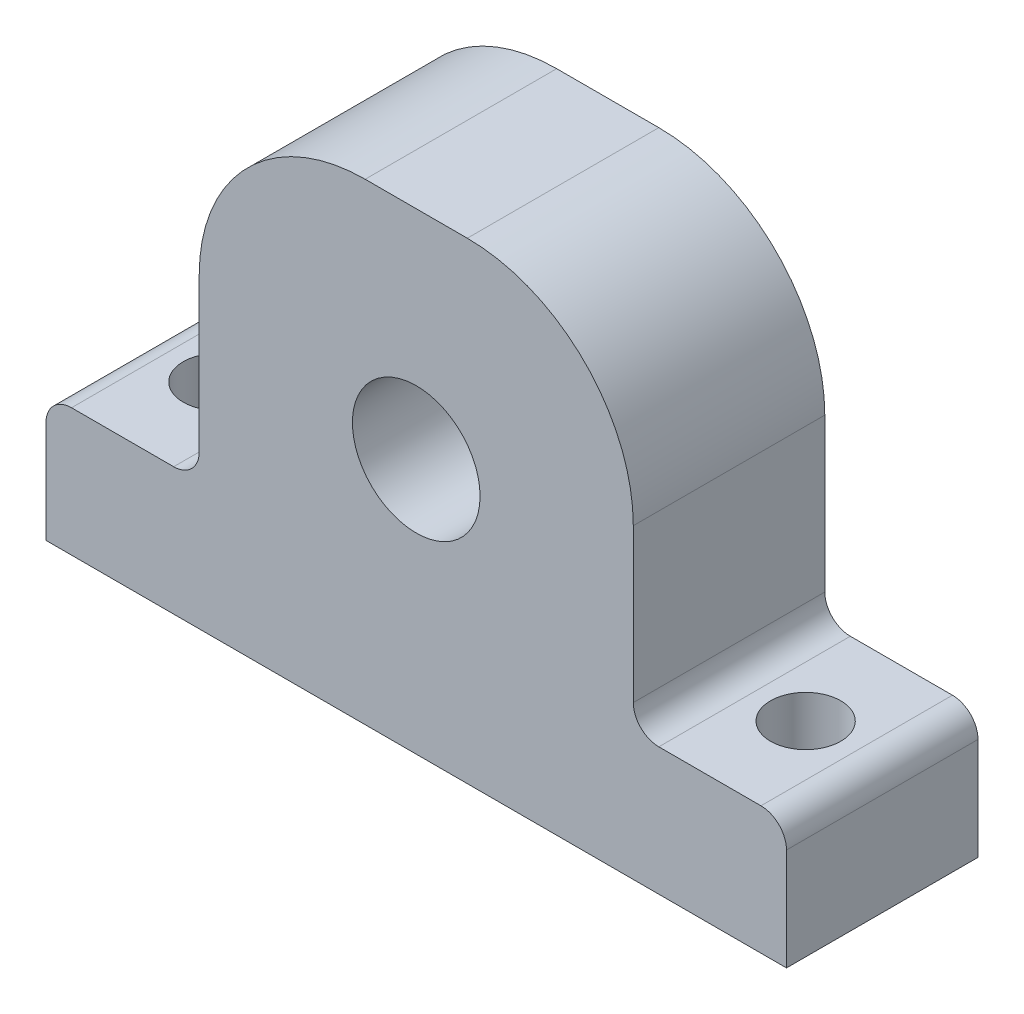
ISO-10303-21;
HEADER;
FILE_DESCRIPTION(('STEP AP214'),'2;1');
FILE_NAME('part.step','',(''),(''),'','','');
FILE_SCHEMA(('AUTOMOTIVE_DESIGN { 1 0 10303 214 1 1 1 1 }'));
ENDSEC;
DATA;
#1=APPLICATION_CONTEXT('core data for automotive mechanical design processes');
#2=APPLICATION_PROTOCOL_DEFINITION('international standard','automotive_design',2000,#1);
#3=PRODUCT_CONTEXT('',#1,'mechanical');
#4=PRODUCT('Part','Part','',(#3));
#5=PRODUCT_RELATED_PRODUCT_CATEGORY('part','',(#4));
#6=PRODUCT_DEFINITION_FORMATION('','',#4);
#7=PRODUCT_DEFINITION_CONTEXT('part definition',#1,'design');
#8=PRODUCT_DEFINITION('design','',#6,#7);
#9=PRODUCT_DEFINITION_SHAPE('','',#8);
#10=(LENGTH_UNIT() NAMED_UNIT(*) SI_UNIT(.MILLI.,.METRE.));
#11=(NAMED_UNIT(*) PLANE_ANGLE_UNIT() SI_UNIT($,.RADIAN.));
#12=(NAMED_UNIT(*) SI_UNIT($,.STERADIAN.) SOLID_ANGLE_UNIT());
#13=UNCERTAINTY_MEASURE_WITH_UNIT(LENGTH_MEASURE(1.E-05),#10,'distance_accuracy_value','');
#14=(GEOMETRIC_REPRESENTATION_CONTEXT(3) GLOBAL_UNCERTAINTY_ASSIGNED_CONTEXT((#13)) GLOBAL_UNIT_ASSIGNED_CONTEXT((#10,
#11,#12)) REPRESENTATION_CONTEXT('',''));
#15=CARTESIAN_POINT('',(0.,0.,0.));
#16=DIRECTION('',(0.,0.,1.));
#17=DIRECTION('',(1.,0.,0.));
#18=AXIS2_PLACEMENT_3D('',#15,#16,#17);
#19=CARTESIAN_POINT('',(0.,-5.,15.));
#20=DIRECTION('',(0.,1.,0.));
#21=DIRECTION('',(0.,0.,1.));
#22=AXIS2_PLACEMENT_3D('',#19,#20,#21);
#23=PLANE('',#22);
#24=CARTESIAN_POINT('',(-23.,-5.,7.5));
#25=DIRECTION('',(0.,1.,0.));
#26=DIRECTION('',(0.,0.,1.));
#27=AXIS2_PLACEMENT_3D('',#24,#25,#26);
#28=CIRCLE('',#27,2.75);
#29=CARTESIAN_POINT('',(-23.,-5.,10.25));
#30=VERTEX_POINT('',#29);
#31=EDGE_CURVE('E359',#30,#30,#28,.T.);
#32=ORIENTED_EDGE('',*,*,#31,.T.);
#33=EDGE_LOOP('',(#32));
#34=FACE_BOUND('',#33,.T.);
#35=CARTESIAN_POINT('',(23.,-5.,7.5));
#36=DIRECTION('',(0.,1.,0.));
#37=DIRECTION('',(0.,0.,1.));
#38=AXIS2_PLACEMENT_3D('',#35,#36,#37);
#39=CIRCLE('',#38,2.75);
#40=CARTESIAN_POINT('',(23.,-5.,10.25));
#41=VERTEX_POINT('',#40);
#42=EDGE_CURVE('E257',#41,#41,#39,.T.);
#43=ORIENTED_EDGE('',*,*,#42,.T.);
#44=EDGE_LOOP('',(#43));
#45=FACE_BOUND('',#44,.T.);
#46=DIRECTION('',(1.,0.,0.));
#47=VECTOR('',#46,1.);
#48=CARTESIAN_POINT('',(0.,-5.,0.));
#49=LINE('',#48,#47);
#50=CARTESIAN_POINT('',(-29.,-5.,0.));
#51=VERTEX_POINT('',#50);
#52=CARTESIAN_POINT('',(29.,-5.,0.));
#53=VERTEX_POINT('',#52);
#54=EDGE_CURVE('E159',#51,#53,#49,.T.);
#55=ORIENTED_EDGE('',*,*,#54,.T.);
#56=DIRECTION('',(0.,0.,-1.));
#57=VECTOR('',#56,1.);
#58=CARTESIAN_POINT('',(29.,-5.,15.));
#59=LINE('',#58,#57);
#60=CARTESIAN_POINT('',(29.,-5.,15.));
#61=VERTEX_POINT('',#60);
#62=EDGE_CURVE('E143',#61,#53,#59,.T.);
#63=ORIENTED_EDGE('',*,*,#62,.F.);
#64=DIRECTION('',(1.,0.,0.));
#65=VECTOR('',#64,1.);
#66=CARTESIAN_POINT('',(0.,-5.,15.));
#67=LINE('',#66,#65);
#68=CARTESIAN_POINT('',(-29.,-5.,15.));
#69=VERTEX_POINT('',#68);
#70=EDGE_CURVE('E147',#69,#61,#67,.T.);
#71=ORIENTED_EDGE('',*,*,#70,.F.);
#72=DIRECTION('',(0.,0.,-1.));
#73=VECTOR('',#72,1.);
#74=CARTESIAN_POINT('',(-29.,-5.,15.));
#75=LINE('',#74,#73);
#76=EDGE_CURVE('E161',#69,#51,#75,.T.);
#77=ORIENTED_EDGE('',*,*,#76,.T.);
#78=EDGE_LOOP('',(#55,#63,#71,#77));
#79=FACE_BOUND('',#78,.T.);
#80=ADVANCED_FACE('F39',(#34,#45,#79),#23,.F.);
#81=CARTESIAN_POINT('',(29.,0.,15.));
#82=DIRECTION('',(1.,0.,0.));
#83=DIRECTION('',(0.,0.,-1.));
#84=AXIS2_PLACEMENT_3D('',#81,#82,#83);
#85=PLANE('',#84);
#86=DIRECTION('',(0.,-1.,0.));
#87=VECTOR('',#86,1.);
#88=CARTESIAN_POINT('',(29.,0.,0.));
#89=LINE('',#88,#87);
#90=CARTESIAN_POINT('',(29.,3.,0.));
#91=VERTEX_POINT('',#90);
#92=EDGE_CURVE('E230',#91,#53,#89,.T.);
#93=ORIENTED_EDGE('',*,*,#92,.F.);
#94=DIRECTION('',(0.,0.,-1.));
#95=VECTOR('',#94,1.);
#96=CARTESIAN_POINT('',(29.,3.,15.));
#97=LINE('',#96,#95);
#98=CARTESIAN_POINT('',(29.,3.,15.));
#99=VERTEX_POINT('',#98);
#100=EDGE_CURVE('E62',#91,#99,#97,.F.);
#101=ORIENTED_EDGE('',*,*,#100,.T.);
#102=DIRECTION('',(0.,-1.,0.));
#103=VECTOR('',#102,1.);
#104=CARTESIAN_POINT('',(29.,0.,15.));
#105=LINE('',#104,#103);
#106=EDGE_CURVE('E139',#99,#61,#105,.T.);
#107=ORIENTED_EDGE('',*,*,#106,.T.);
#108=ORIENTED_EDGE('',*,*,#62,.T.);
#109=EDGE_LOOP('',(#93,#101,#107,#108));
#110=FACE_BOUND('',#109,.T.);
#111=ADVANCED_FACE('F141',(#110),#85,.T.);
#112=CARTESIAN_POINT('',(0.,5.,15.));
#113=DIRECTION('',(0.,1.,0.));
#114=DIRECTION('',(0.,0.,1.));
#115=AXIS2_PLACEMENT_3D('',#112,#113,#114);
#116=PLANE('',#115);
#117=CARTESIAN_POINT('',(23.,5.,7.5));
#118=DIRECTION('',(0.,1.,0.));
#119=DIRECTION('',(0.,0.,1.));
#120=AXIS2_PLACEMENT_3D('',#117,#118,#119);
#121=CIRCLE('',#120,2.75);
#122=CARTESIAN_POINT('',(23.,5.,10.25));
#123=VERTEX_POINT('',#122);
#124=EDGE_CURVE('E354',#123,#123,#121,.T.);
#125=ORIENTED_EDGE('',*,*,#124,.F.);
#126=EDGE_LOOP('',(#125));
#127=FACE_BOUND('',#126,.T.);
#128=DIRECTION('',(1.,0.,0.));
#129=VECTOR('',#128,1.);
#130=CARTESIAN_POINT('',(0.,5.,0.));
#131=LINE('',#130,#129);
#132=CARTESIAN_POINT('',(19.,5.,0.));
#133=VERTEX_POINT('',#132);
#134=CARTESIAN_POINT('',(27.,5.,0.));
#135=VERTEX_POINT('',#134);
#136=EDGE_CURVE('E219',#133,#135,#131,.T.);
#137=ORIENTED_EDGE('',*,*,#136,.F.);
#138=DIRECTION('',(0.,0.,-1.));
#139=VECTOR('',#138,1.);
#140=CARTESIAN_POINT('',(19.,5.,15.));
#141=LINE('',#140,#139);
#142=CARTESIAN_POINT('',(19.,5.,15.));
#143=VERTEX_POINT('',#142);
#144=EDGE_CURVE('E197',#133,#143,#141,.F.);
#145=ORIENTED_EDGE('',*,*,#144,.T.);
#146=DIRECTION('',(1.,0.,0.));
#147=VECTOR('',#146,1.);
#148=CARTESIAN_POINT('',(0.,5.,15.));
#149=LINE('',#148,#147);
#150=CARTESIAN_POINT('',(27.,5.,15.));
#151=VERTEX_POINT('',#150);
#152=EDGE_CURVE('E146',#143,#151,#149,.T.);
#153=ORIENTED_EDGE('',*,*,#152,.T.);
#154=DIRECTION('',(0.,0.,-1.));
#155=VECTOR('',#154,1.);
#156=CARTESIAN_POINT('',(27.,5.,15.));
#157=LINE('',#156,#155);
#158=EDGE_CURVE('E194',#151,#135,#157,.T.);
#159=ORIENTED_EDGE('',*,*,#158,.T.);
#160=EDGE_LOOP('',(#137,#145,#153,#159));
#161=FACE_BOUND('',#160,.T.);
#162=ADVANCED_FACE('F226',(#127,#161),#116,.T.);
#163=CARTESIAN_POINT('',(17.,0.,15.));
#164=DIRECTION('',(1.,0.,0.));
#165=DIRECTION('',(0.,0.,-1.));
#166=AXIS2_PLACEMENT_3D('',#163,#164,#165);
#167=PLANE('',#166);
#168=DIRECTION('',(0.,-1.,0.));
#169=VECTOR('',#168,1.);
#170=CARTESIAN_POINT('',(17.,0.,15.));
#171=LINE('',#170,#169);
#172=CARTESIAN_POINT('',(17.,19.,15.));
#173=VERTEX_POINT('',#172);
#174=CARTESIAN_POINT('',(17.,7.,15.));
#175=VERTEX_POINT('',#174);
#176=EDGE_CURVE('E236',#173,#175,#171,.T.);
#177=ORIENTED_EDGE('',*,*,#176,.T.);
#178=DIRECTION('',(0.,0.,-1.));
#179=VECTOR('',#178,1.);
#180=CARTESIAN_POINT('',(17.,7.,0.));
#181=LINE('',#180,#179);
#182=CARTESIAN_POINT('',(17.,7.,0.));
#183=VERTEX_POINT('',#182);
#184=EDGE_CURVE('E191',#175,#183,#181,.T.);
#185=ORIENTED_EDGE('',*,*,#184,.T.);
#186=DIRECTION('',(0.,-1.,0.));
#187=VECTOR('',#186,1.);
#188=CARTESIAN_POINT('',(17.,0.,0.));
#189=LINE('',#188,#187);
#190=CARTESIAN_POINT('',(17.,19.,0.));
#191=VERTEX_POINT('',#190);
#192=EDGE_CURVE('E221',#191,#183,#189,.T.);
#193=ORIENTED_EDGE('',*,*,#192,.F.);
#194=DIRECTION('',(0.,0.,-1.));
#195=VECTOR('',#194,1.);
#196=CARTESIAN_POINT('',(17.,19.,15.));
#197=LINE('',#196,#195);
#198=EDGE_CURVE('E175',#191,#173,#197,.F.);
#199=ORIENTED_EDGE('',*,*,#198,.T.);
#200=EDGE_LOOP('',(#177,#185,#193,#199));
#201=FACE_BOUND('',#200,.T.);
#202=ADVANCED_FACE('F239',(#201),#167,.T.);
#203=CARTESIAN_POINT('',(0.,32.,15.));
#204=DIRECTION('',(0.,1.,0.));
#205=DIRECTION('',(0.,0.,1.));
#206=AXIS2_PLACEMENT_3D('',#203,#204,#205);
#207=PLANE('',#206);
#208=DIRECTION('',(1.,0.,0.));
#209=VECTOR('',#208,1.);
#210=CARTESIAN_POINT('',(0.,32.,15.));
#211=LINE('',#210,#209);
#212=CARTESIAN_POINT('',(-4.,32.,15.));
#213=VERTEX_POINT('',#212);
#214=CARTESIAN_POINT('',(4.00000000000001,32.,15.));
#215=VERTEX_POINT('',#214);
#216=EDGE_CURVE('E241',#213,#215,#211,.T.);
#217=ORIENTED_EDGE('',*,*,#216,.T.);
#218=DIRECTION('',(0.,0.,-1.));
#219=VECTOR('',#218,1.);
#220=CARTESIAN_POINT('',(4.00000000000001,32.,15.));
#221=LINE('',#220,#219);
#222=CARTESIAN_POINT('',(4.00000000000001,32.,0.));
#223=VERTEX_POINT('',#222);
#224=EDGE_CURVE('E163',#215,#223,#221,.T.);
#225=ORIENTED_EDGE('',*,*,#224,.T.);
#226=DIRECTION('',(1.,0.,0.));
#227=VECTOR('',#226,1.);
#228=CARTESIAN_POINT('',(0.,32.,0.));
#229=LINE('',#228,#227);
#230=CARTESIAN_POINT('',(-4.,32.,0.));
#231=VERTEX_POINT('',#230);
#232=EDGE_CURVE('E260',#231,#223,#229,.T.);
#233=ORIENTED_EDGE('',*,*,#232,.F.);
#234=DIRECTION('',(0.,0.,-1.));
#235=VECTOR('',#234,1.);
#236=CARTESIAN_POINT('',(-4.,32.,15.));
#237=LINE('',#236,#235);
#238=EDGE_CURVE('E160',#231,#213,#237,.F.);
#239=ORIENTED_EDGE('',*,*,#238,.T.);
#240=EDGE_LOOP('',(#217,#225,#233,#239));
#241=FACE_BOUND('',#240,.T.);
#242=ADVANCED_FACE('F336',(#241),#207,.T.);
#243=CARTESIAN_POINT('',(-17.,0.,15.));
#244=DIRECTION('',(1.,0.,0.));
#245=DIRECTION('',(0.,1.,0.));
#246=AXIS2_PLACEMENT_3D('',#243,#244,#245);
#247=PLANE('',#246);
#248=DIRECTION('',(0.,-1.,0.));
#249=VECTOR('',#248,1.);
#250=CARTESIAN_POINT('',(-17.,0.,0.));
#251=LINE('',#250,#249);
#252=CARTESIAN_POINT('',(-17.,19.,0.));
#253=VERTEX_POINT('',#252);
#254=CARTESIAN_POINT('',(-17.,7.,0.));
#255=VERTEX_POINT('',#254);
#256=EDGE_CURVE('E263',#253,#255,#251,.T.);
#257=ORIENTED_EDGE('',*,*,#256,.T.);
#258=DIRECTION('',(0.,0.,-1.));
#259=VECTOR('',#258,1.);
#260=CARTESIAN_POINT('',(-17.,7.,15.));
#261=LINE('',#260,#259);
#262=CARTESIAN_POINT('',(-17.,7.,15.));
#263=VERTEX_POINT('',#262);
#264=EDGE_CURVE('E189',#255,#263,#261,.F.);
#265=ORIENTED_EDGE('',*,*,#264,.T.);
#266=DIRECTION('',(0.,-1.,0.));
#267=VECTOR('',#266,1.);
#268=CARTESIAN_POINT('',(-17.,0.,15.));
#269=LINE('',#268,#267);
#270=CARTESIAN_POINT('',(-17.,19.,15.));
#271=VERTEX_POINT('',#270);
#272=EDGE_CURVE('E244',#271,#263,#269,.T.);
#273=ORIENTED_EDGE('',*,*,#272,.F.);
#274=DIRECTION('',(0.,0.,-1.));
#275=VECTOR('',#274,1.);
#276=CARTESIAN_POINT('',(-17.,19.,0.));
#277=LINE('',#276,#275);
#278=EDGE_CURVE('E181',#271,#253,#277,.T.);
#279=ORIENTED_EDGE('',*,*,#278,.T.);
#280=EDGE_LOOP('',(#257,#265,#273,#279));
#281=FACE_BOUND('',#280,.T.);
#282=ADVANCED_FACE('F330',(#281),#247,.F.);
#283=CARTESIAN_POINT('',(0.,5.,15.));
#284=DIRECTION('',(0.,1.,0.));
#285=DIRECTION('',(0.,0.,1.));
#286=AXIS2_PLACEMENT_3D('',#283,#284,#285);
#287=PLANE('',#286);
#288=CARTESIAN_POINT('',(-23.,5.,7.5));
#289=DIRECTION('',(0.,1.,0.));
#290=DIRECTION('',(0.,0.,1.));
#291=AXIS2_PLACEMENT_3D('',#288,#289,#290);
#292=CIRCLE('',#291,2.75);
#293=CARTESIAN_POINT('',(-23.,5.,10.25));
#294=VERTEX_POINT('',#293);
#295=EDGE_CURVE('E356',#294,#294,#292,.T.);
#296=ORIENTED_EDGE('',*,*,#295,.F.);
#297=EDGE_LOOP('',(#296));
#298=FACE_BOUND('',#297,.T.);
#299=DIRECTION('',(1.,0.,0.));
#300=VECTOR('',#299,1.);
#301=CARTESIAN_POINT('',(0.,5.,15.));
#302=LINE('',#301,#300);
#303=CARTESIAN_POINT('',(-27.,5.,15.));
#304=VERTEX_POINT('',#303);
#305=CARTESIAN_POINT('',(-19.,5.,15.));
#306=VERTEX_POINT('',#305);
#307=EDGE_CURVE('E250',#304,#306,#302,.T.);
#308=ORIENTED_EDGE('',*,*,#307,.T.);
#309=DIRECTION('',(0.,0.,-1.));
#310=VECTOR('',#309,1.);
#311=CARTESIAN_POINT('',(-19.,5.,15.));
#312=LINE('',#311,#310);
#313=CARTESIAN_POINT('',(-19.,5.,0.));
#314=VERTEX_POINT('',#313);
#315=EDGE_CURVE('E186',#306,#314,#312,.T.);
#316=ORIENTED_EDGE('',*,*,#315,.T.);
#317=DIRECTION('',(1.,0.,0.));
#318=VECTOR('',#317,1.);
#319=CARTESIAN_POINT('',(0.,5.,0.));
#320=LINE('',#319,#318);
#321=CARTESIAN_POINT('',(-27.,5.,0.));
#322=VERTEX_POINT('',#321);
#323=EDGE_CURVE('E266',#322,#314,#320,.T.);
#324=ORIENTED_EDGE('',*,*,#323,.F.);
#325=DIRECTION('',(0.,0.,-1.));
#326=VECTOR('',#325,1.);
#327=CARTESIAN_POINT('',(-27.,5.,15.));
#328=LINE('',#327,#326);
#329=EDGE_CURVE('E184',#322,#304,#328,.F.);
#330=ORIENTED_EDGE('',*,*,#329,.T.);
#331=EDGE_LOOP('',(#308,#316,#324,#330));
#332=FACE_BOUND('',#331,.T.);
#333=ADVANCED_FACE('F283',(#298,#332),#287,.T.);
#334=CARTESIAN_POINT('',(-29.,0.,15.));
#335=DIRECTION('',(1.,0.,0.));
#336=DIRECTION('',(0.,0.,-1.));
#337=AXIS2_PLACEMENT_3D('',#334,#335,#336);
#338=PLANE('',#337);
#339=DIRECTION('',(0.,-1.,0.));
#340=VECTOR('',#339,1.);
#341=CARTESIAN_POINT('',(-29.,0.,15.));
#342=LINE('',#341,#340);
#343=CARTESIAN_POINT('',(-29.,3.,15.));
#344=VERTEX_POINT('',#343);
#345=EDGE_CURVE('E152',#344,#69,#342,.T.);
#346=ORIENTED_EDGE('',*,*,#345,.F.);
#347=DIRECTION('',(0.,0.,-1.));
#348=VECTOR('',#347,1.);
#349=CARTESIAN_POINT('',(-29.,3.,0.));
#350=LINE('',#349,#348);
#351=CARTESIAN_POINT('',(-29.,3.,0.));
#352=VERTEX_POINT('',#351);
#353=EDGE_CURVE('E207',#344,#352,#350,.T.);
#354=ORIENTED_EDGE('',*,*,#353,.T.);
#355=DIRECTION('',(0.,-1.,0.));
#356=VECTOR('',#355,1.);
#357=CARTESIAN_POINT('',(-29.,0.,0.));
#358=LINE('',#357,#356);
#359=EDGE_CURVE('E269',#352,#51,#358,.T.);
#360=ORIENTED_EDGE('',*,*,#359,.T.);
#361=ORIENTED_EDGE('',*,*,#76,.F.);
#362=EDGE_LOOP('',(#346,#354,#360,#361));
#363=FACE_BOUND('',#362,.T.);
#364=ADVANCED_FACE('F275',(#363),#338,.F.);
#365=CARTESIAN_POINT('',(0.,15.,15.));
#366=DIRECTION('',(0.,0.,-1.));
#367=DIRECTION('',(-1.,0.,0.));
#368=AXIS2_PLACEMENT_3D('',#365,#366,#367);
#369=CYLINDRICAL_SURFACE('',#368,5.);
#370=CARTESIAN_POINT('',(0.,15.,15.));
#371=DIRECTION('',(0.,0.,1.));
#372=DIRECTION('',(1.,0.,0.));
#373=AXIS2_PLACEMENT_3D('',#370,#371,#372);
#374=CIRCLE('',#373,5.);
#375=CARTESIAN_POINT('',(5.,15.,15.));
#376=VERTEX_POINT('',#375);
#377=EDGE_CURVE('E165',#376,#376,#374,.T.);
#378=ORIENTED_EDGE('',*,*,#377,.T.);
#379=EDGE_LOOP('',(#378));
#380=FACE_BOUND('',#379,.T.);
#381=CARTESIAN_POINT('',(0.,15.,0.));
#382=DIRECTION('',(0.,0.,1.));
#383=DIRECTION('',(1.,0.,0.));
#384=AXIS2_PLACEMENT_3D('',#381,#382,#383);
#385=CIRCLE('',#384,5.);
#386=CARTESIAN_POINT('',(5.,15.,0.));
#387=VERTEX_POINT('',#386);
#388=EDGE_CURVE('E156',#387,#387,#385,.T.);
#389=ORIENTED_EDGE('',*,*,#388,.F.);
#390=EDGE_LOOP('',(#389));
#391=FACE_BOUND('',#390,.T.);
#392=ADVANCED_FACE('F273',(#380,#391),#369,.F.);
#393=CARTESIAN_POINT('',(0.,0.,15.));
#394=DIRECTION('',(0.,0.,1.));
#395=DIRECTION('',(1.,0.,0.));
#396=AXIS2_PLACEMENT_3D('',#393,#394,#395);
#397=PLANE('',#396);
#398=ORIENTED_EDGE('',*,*,#106,.F.);
#399=CARTESIAN_POINT('',(27.,3.,15.));
#400=DIRECTION('',(0.,0.,1.));
#401=DIRECTION('',(1.,0.,0.));
#402=AXIS2_PLACEMENT_3D('',#399,#400,#401);
#403=CIRCLE('',#402,2.);
#404=EDGE_CURVE('E205',#99,#151,#403,.T.);
#405=ORIENTED_EDGE('',*,*,#404,.T.);
#406=ORIENTED_EDGE('',*,*,#152,.F.);
#407=CARTESIAN_POINT('',(19.,7.,15.));
#408=DIRECTION('',(0.,0.,1.));
#409=DIRECTION('',(1.,0.,0.));
#410=AXIS2_PLACEMENT_3D('',#407,#408,#409);
#411=CIRCLE('',#410,2.);
#412=EDGE_CURVE('E11',#143,#175,#411,.F.);
#413=ORIENTED_EDGE('',*,*,#412,.T.);
#414=ORIENTED_EDGE('',*,*,#176,.F.);
#415=CARTESIAN_POINT('',(4.00000000000001,19.,15.));
#416=DIRECTION('',(0.,0.,1.));
#417=DIRECTION('',(1.,0.,0.));
#418=AXIS2_PLACEMENT_3D('',#415,#416,#417);
#419=CIRCLE('',#418,13.);
#420=EDGE_CURVE('E179',#173,#215,#419,.T.);
#421=ORIENTED_EDGE('',*,*,#420,.T.);
#422=ORIENTED_EDGE('',*,*,#216,.F.);
#423=CARTESIAN_POINT('',(-4.,19.,15.));
#424=DIRECTION('',(0.,0.,1.));
#425=DIRECTION('',(1.,0.,0.));
#426=AXIS2_PLACEMENT_3D('',#423,#424,#425);
#427=CIRCLE('',#426,13.);
#428=EDGE_CURVE('E177',#213,#271,#427,.T.);
#429=ORIENTED_EDGE('',*,*,#428,.T.);
#430=ORIENTED_EDGE('',*,*,#272,.T.);
#431=CARTESIAN_POINT('',(-19.,7.,15.));
#432=DIRECTION('',(0.,0.,1.));
#433=DIRECTION('',(1.,0.,0.));
#434=AXIS2_PLACEMENT_3D('',#431,#432,#433);
#435=CIRCLE('',#434,2.);
#436=EDGE_CURVE('E212',#263,#306,#435,.F.);
#437=ORIENTED_EDGE('',*,*,#436,.T.);
#438=ORIENTED_EDGE('',*,*,#307,.F.);
#439=CARTESIAN_POINT('',(-27.,3.,15.));
#440=DIRECTION('',(0.,0.,1.));
#441=DIRECTION('',(1.,0.,0.));
#442=AXIS2_PLACEMENT_3D('',#439,#440,#441);
#443=CIRCLE('',#442,2.);
#444=EDGE_CURVE('E54',#304,#344,#443,.T.);
#445=ORIENTED_EDGE('',*,*,#444,.T.);
#446=ORIENTED_EDGE('',*,*,#345,.T.);
#447=ORIENTED_EDGE('',*,*,#70,.T.);
#448=EDGE_LOOP('',(#398,#405,#406,#413,#414,#421,#422,#429,#430,#437,#438,#445,#446,#447));
#449=FACE_BOUND('',#448,.T.);
#450=ORIENTED_EDGE('',*,*,#377,.F.);
#451=EDGE_LOOP('',(#450));
#452=FACE_BOUND('',#451,.T.);
#453=ADVANCED_FACE('F150',(#449,#452),#397,.T.);
#454=CARTESIAN_POINT('',(0.,0.,0.));
#455=DIRECTION('',(0.,0.,1.));
#456=DIRECTION('',(1.,0.,0.));
#457=AXIS2_PLACEMENT_3D('',#454,#455,#456);
#458=PLANE('',#457);
#459=ORIENTED_EDGE('',*,*,#136,.T.);
#460=CARTESIAN_POINT('',(27.,3.,0.));
#461=DIRECTION('',(0.,0.,1.));
#462=DIRECTION('',(1.,0.,0.));
#463=AXIS2_PLACEMENT_3D('',#460,#461,#462);
#464=CIRCLE('',#463,2.);
#465=EDGE_CURVE('E201',#135,#91,#464,.F.);
#466=ORIENTED_EDGE('',*,*,#465,.T.);
#467=ORIENTED_EDGE('',*,*,#92,.T.);
#468=ORIENTED_EDGE('',*,*,#54,.F.);
#469=ORIENTED_EDGE('',*,*,#359,.F.);
#470=CARTESIAN_POINT('',(-27.,3.,0.));
#471=DIRECTION('',(0.,0.,1.));
#472=DIRECTION('',(1.,0.,0.));
#473=AXIS2_PLACEMENT_3D('',#470,#471,#472);
#474=CIRCLE('',#473,2.);
#475=EDGE_CURVE('E199',#352,#322,#474,.F.);
#476=ORIENTED_EDGE('',*,*,#475,.T.);
#477=ORIENTED_EDGE('',*,*,#323,.T.);
#478=CARTESIAN_POINT('',(-19.,7.,0.));
#479=DIRECTION('',(0.,0.,1.));
#480=DIRECTION('',(1.,0.,0.));
#481=AXIS2_PLACEMENT_3D('',#478,#479,#480);
#482=CIRCLE('',#481,2.);
#483=EDGE_CURVE('E210',#314,#255,#482,.T.);
#484=ORIENTED_EDGE('',*,*,#483,.T.);
#485=ORIENTED_EDGE('',*,*,#256,.F.);
#486=CARTESIAN_POINT('',(-4.,19.,0.));
#487=DIRECTION('',(0.,0.,1.));
#488=DIRECTION('',(1.,0.,0.));
#489=AXIS2_PLACEMENT_3D('',#486,#487,#488);
#490=CIRCLE('',#489,13.);
#491=EDGE_CURVE('E171',#253,#231,#490,.F.);
#492=ORIENTED_EDGE('',*,*,#491,.T.);
#493=ORIENTED_EDGE('',*,*,#232,.T.);
#494=CARTESIAN_POINT('',(4.00000000000001,19.,0.));
#495=DIRECTION('',(0.,0.,1.));
#496=DIRECTION('',(1.,0.,0.));
#497=AXIS2_PLACEMENT_3D('',#494,#495,#496);
#498=CIRCLE('',#497,13.);
#499=EDGE_CURVE('E173',#223,#191,#498,.F.);
#500=ORIENTED_EDGE('',*,*,#499,.T.);
#501=ORIENTED_EDGE('',*,*,#192,.T.);
#502=CARTESIAN_POINT('',(19.,7.,0.));
#503=DIRECTION('',(0.,0.,1.));
#504=DIRECTION('',(1.,0.,0.));
#505=AXIS2_PLACEMENT_3D('',#502,#503,#504);
#506=CIRCLE('',#505,2.);
#507=EDGE_CURVE('E47',#183,#133,#506,.T.);
#508=ORIENTED_EDGE('',*,*,#507,.T.);
#509=EDGE_LOOP('',(#459,#466,#467,#468,#469,#476,#477,#484,#485,#492,#493,#500,#501,#508));
#510=FACE_BOUND('',#509,.T.);
#511=ORIENTED_EDGE('',*,*,#388,.T.);
#512=EDGE_LOOP('',(#511));
#513=FACE_BOUND('',#512,.T.);
#514=ADVANCED_FACE('F217',(#510,#513),#458,.F.);
#515=CARTESIAN_POINT('',(-23.,-10.,7.5));
#516=DIRECTION('',(0.,1.,0.));
#517=DIRECTION('',(0.,0.,1.));
#518=AXIS2_PLACEMENT_3D('',#515,#516,#517);
#519=CYLINDRICAL_SURFACE('',#518,2.75);
#520=ORIENTED_EDGE('',*,*,#295,.T.);
#521=EDGE_LOOP('',(#520));
#522=FACE_BOUND('',#521,.T.);
#523=ORIENTED_EDGE('',*,*,#31,.F.);
#524=EDGE_LOOP('',(#523));
#525=FACE_BOUND('',#524,.T.);
#526=ADVANCED_FACE('F367',(#522,#525),#519,.F.);
#527=CARTESIAN_POINT('',(23.,-10.,7.5));
#528=DIRECTION('',(0.,1.,0.));
#529=DIRECTION('',(0.,0.,1.));
#530=AXIS2_PLACEMENT_3D('',#527,#528,#529);
#531=CYLINDRICAL_SURFACE('',#530,2.75);
#532=ORIENTED_EDGE('',*,*,#124,.T.);
#533=EDGE_LOOP('',(#532));
#534=FACE_BOUND('',#533,.T.);
#535=ORIENTED_EDGE('',*,*,#42,.F.);
#536=EDGE_LOOP('',(#535));
#537=FACE_BOUND('',#536,.T.);
#538=ADVANCED_FACE('F302',(#534,#537),#531,.F.);
#539=CARTESIAN_POINT('',(4.00000000000001,19.,15.));
#540=DIRECTION('',(0.,0.,-1.));
#541=DIRECTION('',(-1.,0.,0.));
#542=AXIS2_PLACEMENT_3D('',#539,#540,#541);
#543=CYLINDRICAL_SURFACE('',#542,13.);
#544=ORIENTED_EDGE('',*,*,#420,.F.);
#545=ORIENTED_EDGE('',*,*,#198,.F.);
#546=ORIENTED_EDGE('',*,*,#499,.F.);
#547=ORIENTED_EDGE('',*,*,#224,.F.);
#548=EDGE_LOOP('',(#544,#545,#546,#547));
#549=FACE_BOUND('',#548,.T.);
#550=ADVANCED_FACE('F298',(#549),#543,.T.);
#551=CARTESIAN_POINT('',(-4.,19.,15.));
#552=DIRECTION('',(0.,0.,1.));
#553=DIRECTION('',(1.,0.,0.));
#554=AXIS2_PLACEMENT_3D('',#551,#552,#553);
#555=CYLINDRICAL_SURFACE('',#554,13.);
#556=ORIENTED_EDGE('',*,*,#428,.F.);
#557=ORIENTED_EDGE('',*,*,#238,.F.);
#558=ORIENTED_EDGE('',*,*,#491,.F.);
#559=ORIENTED_EDGE('',*,*,#278,.F.);
#560=EDGE_LOOP('',(#556,#557,#558,#559));
#561=FACE_BOUND('',#560,.T.);
#562=ADVANCED_FACE('F301',(#561),#555,.T.);
#563=CARTESIAN_POINT('',(-19.,7.,15.));
#564=DIRECTION('',(0.,0.,-1.));
#565=DIRECTION('',(-1.,0.,0.));
#566=AXIS2_PLACEMENT_3D('',#563,#564,#565);
#567=CYLINDRICAL_SURFACE('',#566,2.);
#568=ORIENTED_EDGE('',*,*,#436,.F.);
#569=ORIENTED_EDGE('',*,*,#264,.F.);
#570=ORIENTED_EDGE('',*,*,#483,.F.);
#571=ORIENTED_EDGE('',*,*,#315,.F.);
#572=EDGE_LOOP('',(#568,#569,#570,#571));
#573=FACE_BOUND('',#572,.T.);
#574=ADVANCED_FACE('F306',(#573),#567,.F.);
#575=CARTESIAN_POINT('',(19.,7.,15.));
#576=DIRECTION('',(0.,0.,1.));
#577=DIRECTION('',(1.,0.,0.));
#578=AXIS2_PLACEMENT_3D('',#575,#576,#577);
#579=CYLINDRICAL_SURFACE('',#578,2.);
#580=ORIENTED_EDGE('',*,*,#412,.F.);
#581=ORIENTED_EDGE('',*,*,#144,.F.);
#582=ORIENTED_EDGE('',*,*,#507,.F.);
#583=ORIENTED_EDGE('',*,*,#184,.F.);
#584=EDGE_LOOP('',(#580,#581,#582,#583));
#585=FACE_BOUND('',#584,.T.);
#586=ADVANCED_FACE('F233',(#585),#579,.F.);
#587=CARTESIAN_POINT('',(27.,3.,15.));
#588=DIRECTION('',(0.,0.,-1.));
#589=DIRECTION('',(-1.,0.,0.));
#590=AXIS2_PLACEMENT_3D('',#587,#588,#589);
#591=CYLINDRICAL_SURFACE('',#590,2.);
#592=ORIENTED_EDGE('',*,*,#404,.F.);
#593=ORIENTED_EDGE('',*,*,#100,.F.);
#594=ORIENTED_EDGE('',*,*,#465,.F.);
#595=ORIENTED_EDGE('',*,*,#158,.F.);
#596=EDGE_LOOP('',(#592,#593,#594,#595));
#597=FACE_BOUND('',#596,.T.);
#598=ADVANCED_FACE('F312',(#597),#591,.T.);
#599=CARTESIAN_POINT('',(-27.,3.,15.));
#600=DIRECTION('',(0.,0.,1.));
#601=DIRECTION('',(1.,0.,0.));
#602=AXIS2_PLACEMENT_3D('',#599,#600,#601);
#603=CYLINDRICAL_SURFACE('',#602,2.);
#604=ORIENTED_EDGE('',*,*,#444,.F.);
#605=ORIENTED_EDGE('',*,*,#329,.F.);
#606=ORIENTED_EDGE('',*,*,#475,.F.);
#607=ORIENTED_EDGE('',*,*,#353,.F.);
#608=EDGE_LOOP('',(#604,#605,#606,#607));
#609=FACE_BOUND('',#608,.T.);
#610=ADVANCED_FACE('F41',(#609),#603,.T.);
#611=CLOSED_SHELL('',(#80,#111,#162,#202,#242,#282,#333,#364,#392,#453,#514,#526,#538,#550,#562,
#574,#586,#598,#610));
#612=MANIFOLD_SOLID_BREP('B2',#611);
#613=ADVANCED_BREP_SHAPE_REPRESENTATION('',(#18,#612),#14);
#614=SHAPE_DEFINITION_REPRESENTATION(#9,#613);
ENDSEC;
END-ISO-10303-21;
